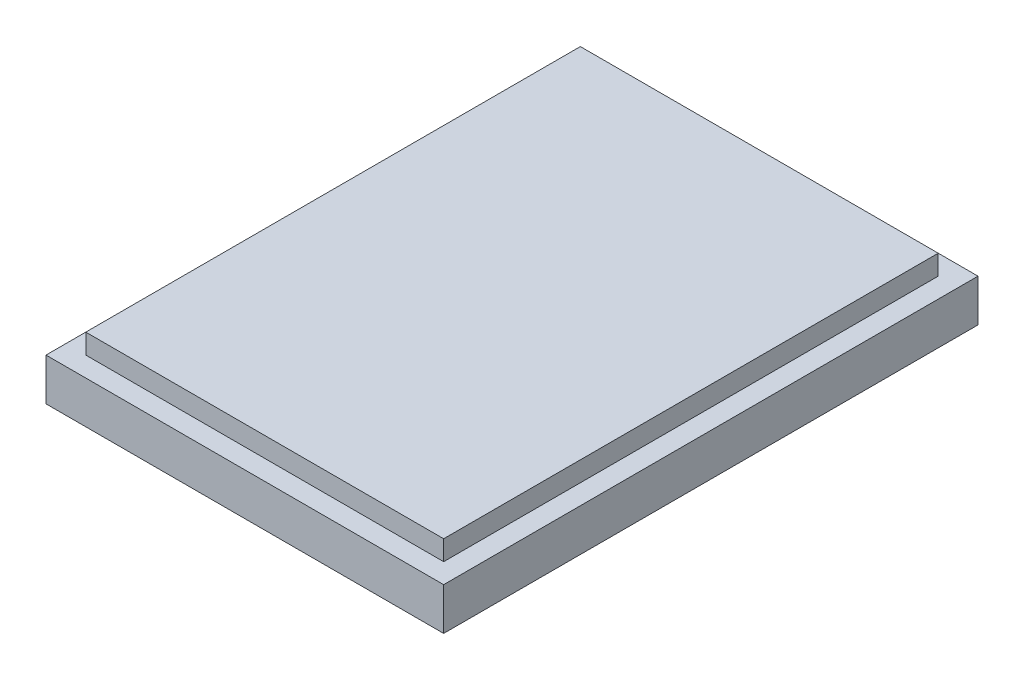
ISO-10303-21;
HEADER;
FILE_DESCRIPTION(('STEP AP214'),'2;1');
FILE_NAME('part.step','',(''),(''),'','','');
FILE_SCHEMA(('AUTOMOTIVE_DESIGN { 1 0 10303 214 1 1 1 1 }'));
ENDSEC;
DATA;
#1=APPLICATION_CONTEXT('core data for automotive mechanical design processes');
#2=APPLICATION_PROTOCOL_DEFINITION('international standard','automotive_design',2000,#1);
#3=PRODUCT_CONTEXT('',#1,'mechanical');
#4=PRODUCT('Part','Part','',(#3));
#5=PRODUCT_RELATED_PRODUCT_CATEGORY('part','',(#4));
#6=PRODUCT_DEFINITION_FORMATION('','',#4);
#7=PRODUCT_DEFINITION_CONTEXT('part definition',#1,'design');
#8=PRODUCT_DEFINITION('design','',#6,#7);
#9=PRODUCT_DEFINITION_SHAPE('','',#8);
#10=(LENGTH_UNIT() NAMED_UNIT(*) SI_UNIT(.MILLI.,.METRE.));
#11=(NAMED_UNIT(*) PLANE_ANGLE_UNIT() SI_UNIT($,.RADIAN.));
#12=(NAMED_UNIT(*) SI_UNIT($,.STERADIAN.) SOLID_ANGLE_UNIT());
#13=UNCERTAINTY_MEASURE_WITH_UNIT(LENGTH_MEASURE(1.E-05),#10,'distance_accuracy_value','');
#14=(GEOMETRIC_REPRESENTATION_CONTEXT(3) GLOBAL_UNCERTAINTY_ASSIGNED_CONTEXT((#13)) GLOBAL_UNIT_ASSIGNED_CONTEXT((#10,
#11,#12)) REPRESENTATION_CONTEXT('',''));
#15=CARTESIAN_POINT('',(0.,0.,0.));
#16=DIRECTION('',(0.,0.,1.));
#17=DIRECTION('',(1.,0.,0.));
#18=AXIS2_PLACEMENT_3D('',#15,#16,#17);
#19=CARTESIAN_POINT('',(0.,7.9375,0.));
#20=DIRECTION('',(1.,0.,0.));
#21=DIRECTION('',(0.,0.,-1.));
#22=AXIS2_PLACEMENT_3D('',#19,#20,#21);
#23=PLANE('',#22);
#24=DIRECTION('',(0.,0.,1.));
#25=VECTOR('',#24,1.);
#26=CARTESIAN_POINT('',(0.,5.3975,-68.2625));
#27=LINE('',#26,#25);
#28=CARTESIAN_POINT('',(0.,5.3975,-68.2625));
#29=VERTEX_POINT('',#28);
#30=CARTESIAN_POINT('',(0.,5.3975,0.));
#31=VERTEX_POINT('',#30);
#32=EDGE_CURVE('E158',#29,#31,#27,.T.);
#33=ORIENTED_EDGE('',*,*,#32,.F.);
#34=DIRECTION('',(0.,-1.,0.));
#35=VECTOR('',#34,1.);
#36=CARTESIAN_POINT('',(0.,7.9375,-68.2625));
#37=LINE('',#36,#35);
#38=CARTESIAN_POINT('',(0.,0.,-68.2625));
#39=VERTEX_POINT('',#38);
#40=EDGE_CURVE('E190',#29,#39,#37,.T.);
#41=ORIENTED_EDGE('',*,*,#40,.T.);
#42=DIRECTION('',(0.,0.,1.));
#43=VECTOR('',#42,1.);
#44=CARTESIAN_POINT('',(0.,0.,0.));
#45=LINE('',#44,#43);
#46=CARTESIAN_POINT('',(0.,0.,0.));
#47=VERTEX_POINT('',#46);
#48=EDGE_CURVE('E174',#39,#47,#45,.T.);
#49=ORIENTED_EDGE('',*,*,#48,.T.);
#50=DIRECTION('',(0.,-1.,0.));
#51=VECTOR('',#50,1.);
#52=CARTESIAN_POINT('',(0.,7.9375,0.));
#53=LINE('',#52,#51);
#54=EDGE_CURVE('E12',#31,#47,#53,.T.);
#55=ORIENTED_EDGE('',*,*,#54,.F.);
#56=EDGE_LOOP('',(#33,#41,#49,#55));
#57=FACE_BOUND('',#56,.T.);
#58=ADVANCED_FACE('F47',(#57),#23,.F.);
#59=CARTESIAN_POINT('',(0.,7.9375,0.));
#60=DIRECTION('',(0.,0.,-1.));
#61=DIRECTION('',(-1.,0.,0.));
#62=AXIS2_PLACEMENT_3D('',#59,#60,#61);
#63=PLANE('',#62);
#64=DIRECTION('',(1.,0.,0.));
#65=VECTOR('',#64,1.);
#66=CARTESIAN_POINT('',(0.,5.3975,0.));
#67=LINE('',#66,#65);
#68=CARTESIAN_POINT('',(50.8,5.3975,0.));
#69=VERTEX_POINT('',#68);
#70=EDGE_CURVE('E166',#31,#69,#67,.T.);
#71=ORIENTED_EDGE('',*,*,#70,.F.);
#72=ORIENTED_EDGE('',*,*,#54,.T.);
#73=DIRECTION('',(1.,0.,0.));
#74=VECTOR('',#73,1.);
#75=CARTESIAN_POINT('',(0.,0.,0.));
#76=LINE('',#75,#74);
#77=CARTESIAN_POINT('',(50.8,0.,0.));
#78=VERTEX_POINT('',#77);
#79=EDGE_CURVE('E178',#47,#78,#76,.T.);
#80=ORIENTED_EDGE('',*,*,#79,.T.);
#81=DIRECTION('',(0.,-1.,0.));
#82=VECTOR('',#81,1.);
#83=CARTESIAN_POINT('',(50.8,7.9375,0.));
#84=LINE('',#83,#82);
#85=EDGE_CURVE('E55',#69,#78,#84,.T.);
#86=ORIENTED_EDGE('',*,*,#85,.F.);
#87=EDGE_LOOP('',(#71,#72,#80,#86));
#88=FACE_BOUND('',#87,.T.);
#89=ADVANCED_FACE('F205',(#88),#63,.F.);
#90=CARTESIAN_POINT('',(50.8,7.9375,0.));
#91=DIRECTION('',(-1.,0.,0.));
#92=DIRECTION('',(0.,0.,1.));
#93=AXIS2_PLACEMENT_3D('',#90,#91,#92);
#94=PLANE('',#93);
#95=DIRECTION('',(0.,0.,-1.));
#96=VECTOR('',#95,1.);
#97=CARTESIAN_POINT('',(50.8,5.3975,0.));
#98=LINE('',#97,#96);
#99=CARTESIAN_POINT('',(50.8,5.3975,-68.2625));
#100=VERTEX_POINT('',#99);
#101=EDGE_CURVE('E62',#69,#100,#98,.T.);
#102=ORIENTED_EDGE('',*,*,#101,.F.);
#103=ORIENTED_EDGE('',*,*,#85,.T.);
#104=DIRECTION('',(0.,0.,-1.));
#105=VECTOR('',#104,1.);
#106=CARTESIAN_POINT('',(50.8,0.,0.));
#107=LINE('',#106,#105);
#108=CARTESIAN_POINT('',(50.8,0.,-68.2625));
#109=VERTEX_POINT('',#108);
#110=EDGE_CURVE('E182',#78,#109,#107,.T.);
#111=ORIENTED_EDGE('',*,*,#110,.T.);
#112=DIRECTION('',(0.,-1.,0.));
#113=VECTOR('',#112,1.);
#114=CARTESIAN_POINT('',(50.8,7.9375,-68.2625));
#115=LINE('',#114,#113);
#116=EDGE_CURVE('E193',#100,#109,#115,.T.);
#117=ORIENTED_EDGE('',*,*,#116,.F.);
#118=EDGE_LOOP('',(#102,#103,#111,#117));
#119=FACE_BOUND('',#118,.T.);
#120=ADVANCED_FACE('F198',(#119),#94,.F.);
#121=CARTESIAN_POINT('',(0.,7.9375,-68.2625));
#122=DIRECTION('',(0.,0.,1.));
#123=DIRECTION('',(1.,0.,0.));
#124=AXIS2_PLACEMENT_3D('',#121,#122,#123);
#125=PLANE('',#124);
#126=DIRECTION('',(-1.,0.,0.));
#127=VECTOR('',#126,1.);
#128=CARTESIAN_POINT('',(50.8,5.3975,-68.2625));
#129=LINE('',#128,#127);
#130=EDGE_CURVE('E171',#100,#29,#129,.T.);
#131=ORIENTED_EDGE('',*,*,#130,.F.);
#132=ORIENTED_EDGE('',*,*,#116,.T.);
#133=DIRECTION('',(-1.,0.,0.));
#134=VECTOR('',#133,1.);
#135=CARTESIAN_POINT('',(0.,0.,-68.2625));
#136=LINE('',#135,#134);
#137=EDGE_CURVE('E186',#109,#39,#136,.T.);
#138=ORIENTED_EDGE('',*,*,#137,.T.);
#139=ORIENTED_EDGE('',*,*,#40,.F.);
#140=EDGE_LOOP('',(#131,#132,#138,#139));
#141=FACE_BOUND('',#140,.T.);
#142=ADVANCED_FACE('F212',(#141),#125,.F.);
#143=CARTESIAN_POINT('',(0.,0.,0.));
#144=DIRECTION('',(0.,-1.,0.));
#145=DIRECTION('',(0.,0.,-1.));
#146=AXIS2_PLACEMENT_3D('',#143,#144,#145);
#147=PLANE('',#146);
#148=ORIENTED_EDGE('',*,*,#48,.F.);
#149=ORIENTED_EDGE('',*,*,#137,.F.);
#150=ORIENTED_EDGE('',*,*,#110,.F.);
#151=ORIENTED_EDGE('',*,*,#79,.F.);
#152=EDGE_LOOP('',(#148,#149,#150,#151));
#153=FACE_BOUND('',#152,.T.);
#154=ADVANCED_FACE('F209',(#153),#147,.T.);
#155=CARTESIAN_POINT('',(0.,5.3975,0.));
#156=DIRECTION('',(0.,1.,0.));
#157=DIRECTION('',(0.,0.,1.));
#158=AXIS2_PLACEMENT_3D('',#155,#156,#157);
#159=PLANE('',#158);
#160=DIRECTION('',(0.,0.,-1.));
#161=VECTOR('',#160,1.);
#162=CARTESIAN_POINT('',(48.26,5.3975,-2.54));
#163=LINE('',#162,#161);
#164=CARTESIAN_POINT('',(48.26,5.3975,-2.54));
#165=VERTEX_POINT('',#164);
#166=CARTESIAN_POINT('',(48.26,5.3975,-65.7225));
#167=VERTEX_POINT('',#166);
#168=EDGE_CURVE('E124',#165,#167,#163,.T.);
#169=ORIENTED_EDGE('',*,*,#168,.F.);
#170=DIRECTION('',(1.,0.,0.));
#171=VECTOR('',#170,1.);
#172=CARTESIAN_POINT('',(2.54,5.3975,-2.54));
#173=LINE('',#172,#171);
#174=CARTESIAN_POINT('',(2.54,5.3975,-2.54));
#175=VERTEX_POINT('',#174);
#176=EDGE_CURVE('E133',#175,#165,#173,.T.);
#177=ORIENTED_EDGE('',*,*,#176,.F.);
#178=DIRECTION('',(0.,0.,1.));
#179=VECTOR('',#178,1.);
#180=CARTESIAN_POINT('',(2.54,5.3975,-65.7225));
#181=LINE('',#180,#179);
#182=CARTESIAN_POINT('',(2.54,5.3975,-65.7225));
#183=VERTEX_POINT('',#182);
#184=EDGE_CURVE('E115',#183,#175,#181,.T.);
#185=ORIENTED_EDGE('',*,*,#184,.F.);
#186=DIRECTION('',(-1.,0.,0.));
#187=VECTOR('',#186,1.);
#188=CARTESIAN_POINT('',(48.26,5.3975,-65.7225));
#189=LINE('',#188,#187);
#190=EDGE_CURVE('E130',#167,#183,#189,.T.);
#191=ORIENTED_EDGE('',*,*,#190,.F.);
#192=EDGE_LOOP('',(#169,#177,#185,#191));
#193=FACE_BOUND('',#192,.T.);
#194=ORIENTED_EDGE('',*,*,#32,.T.);
#195=ORIENTED_EDGE('',*,*,#70,.T.);
#196=ORIENTED_EDGE('',*,*,#101,.T.);
#197=ORIENTED_EDGE('',*,*,#130,.T.);
#198=EDGE_LOOP('',(#194,#195,#196,#197));
#199=FACE_BOUND('',#198,.T.);
#200=ADVANCED_FACE('F129',(#193,#199),#159,.T.);
#201=CARTESIAN_POINT('',(48.26,5.3975,-65.7225));
#202=DIRECTION('',(0.,0.,-1.));
#203=DIRECTION('',(-1.,0.,0.));
#204=AXIS2_PLACEMENT_3D('',#201,#202,#203);
#205=PLANE('',#204);
#206=DIRECTION('',(-1.,0.,0.));
#207=VECTOR('',#206,1.);
#208=CARTESIAN_POINT('',(48.26,7.9375,-65.7225));
#209=LINE('',#208,#207);
#210=CARTESIAN_POINT('',(48.26,7.9375,-65.7225));
#211=VERTEX_POINT('',#210);
#212=CARTESIAN_POINT('',(2.54,7.9375,-65.7225));
#213=VERTEX_POINT('',#212);
#214=EDGE_CURVE('E149',#211,#213,#209,.T.);
#215=ORIENTED_EDGE('',*,*,#214,.F.);
#216=DIRECTION('',(0.,1.,0.));
#217=VECTOR('',#216,1.);
#218=CARTESIAN_POINT('',(48.26,5.3975,-65.7225));
#219=LINE('',#218,#217);
#220=EDGE_CURVE('E137',#167,#211,#219,.T.);
#221=ORIENTED_EDGE('',*,*,#220,.F.);
#222=ORIENTED_EDGE('',*,*,#190,.T.);
#223=DIRECTION('',(0.,1.,0.));
#224=VECTOR('',#223,1.);
#225=CARTESIAN_POINT('',(2.54,5.3975,-65.7225));
#226=LINE('',#225,#224);
#227=EDGE_CURVE('E112',#183,#213,#226,.T.);
#228=ORIENTED_EDGE('',*,*,#227,.T.);
#229=EDGE_LOOP('',(#215,#221,#222,#228));
#230=FACE_BOUND('',#229,.T.);
#231=ADVANCED_FACE('F136',(#230),#205,.T.);
#232=CARTESIAN_POINT('',(48.26,5.3975,-2.54));
#233=DIRECTION('',(1.,0.,0.));
#234=DIRECTION('',(0.,0.,-1.));
#235=AXIS2_PLACEMENT_3D('',#232,#233,#234);
#236=PLANE('',#235);
#237=DIRECTION('',(0.,0.,-1.));
#238=VECTOR('',#237,1.);
#239=CARTESIAN_POINT('',(48.26,7.9375,-2.54));
#240=LINE('',#239,#238);
#241=CARTESIAN_POINT('',(48.26,7.9375,-2.54));
#242=VERTEX_POINT('',#241);
#243=EDGE_CURVE('E139',#242,#211,#240,.T.);
#244=ORIENTED_EDGE('',*,*,#243,.F.);
#245=DIRECTION('',(0.,1.,0.));
#246=VECTOR('',#245,1.);
#247=CARTESIAN_POINT('',(48.26,5.3975,-2.54));
#248=LINE('',#247,#246);
#249=EDGE_CURVE('E159',#165,#242,#248,.T.);
#250=ORIENTED_EDGE('',*,*,#249,.F.);
#251=ORIENTED_EDGE('',*,*,#168,.T.);
#252=ORIENTED_EDGE('',*,*,#220,.T.);
#253=EDGE_LOOP('',(#244,#250,#251,#252));
#254=FACE_BOUND('',#253,.T.);
#255=ADVANCED_FACE('F237',(#254),#236,.T.);
#256=CARTESIAN_POINT('',(2.54,5.3975,-2.54));
#257=DIRECTION('',(0.,0.,1.));
#258=DIRECTION('',(1.,0.,0.));
#259=AXIS2_PLACEMENT_3D('',#256,#257,#258);
#260=PLANE('',#259);
#261=DIRECTION('',(1.,0.,0.));
#262=VECTOR('',#261,1.);
#263=CARTESIAN_POINT('',(2.54,7.9375,-2.54));
#264=LINE('',#263,#262);
#265=CARTESIAN_POINT('',(2.54,7.9375,-2.54));
#266=VERTEX_POINT('',#265);
#267=EDGE_CURVE('E70',#266,#242,#264,.T.);
#268=ORIENTED_EDGE('',*,*,#267,.F.);
#269=DIRECTION('',(0.,1.,0.));
#270=VECTOR('',#269,1.);
#271=CARTESIAN_POINT('',(2.54,5.3975,-2.54));
#272=LINE('',#271,#270);
#273=EDGE_CURVE('E123',#175,#266,#272,.T.);
#274=ORIENTED_EDGE('',*,*,#273,.F.);
#275=ORIENTED_EDGE('',*,*,#176,.T.);
#276=ORIENTED_EDGE('',*,*,#249,.T.);
#277=EDGE_LOOP('',(#268,#274,#275,#276));
#278=FACE_BOUND('',#277,.T.);
#279=ADVANCED_FACE('F240',(#278),#260,.T.);
#280=CARTESIAN_POINT('',(2.54,5.3975,-65.7225));
#281=DIRECTION('',(-1.,0.,0.));
#282=DIRECTION('',(0.,0.,1.));
#283=AXIS2_PLACEMENT_3D('',#280,#281,#282);
#284=PLANE('',#283);
#285=DIRECTION('',(0.,0.,1.));
#286=VECTOR('',#285,1.);
#287=CARTESIAN_POINT('',(2.54,7.9375,-65.7225));
#288=LINE('',#287,#286);
#289=EDGE_CURVE('E117',#213,#266,#288,.T.);
#290=ORIENTED_EDGE('',*,*,#289,.F.);
#291=ORIENTED_EDGE('',*,*,#227,.F.);
#292=ORIENTED_EDGE('',*,*,#184,.T.);
#293=ORIENTED_EDGE('',*,*,#273,.T.);
#294=EDGE_LOOP('',(#290,#291,#292,#293));
#295=FACE_BOUND('',#294,.T.);
#296=ADVANCED_FACE('F114',(#295),#284,.T.);
#297=CARTESIAN_POINT('',(0.,7.9375,0.));
#298=DIRECTION('',(0.,-1.,0.));
#299=DIRECTION('',(0.,0.,-1.));
#300=AXIS2_PLACEMENT_3D('',#297,#298,#299);
#301=PLANE('',#300);
#302=ORIENTED_EDGE('',*,*,#214,.T.);
#303=ORIENTED_EDGE('',*,*,#289,.T.);
#304=ORIENTED_EDGE('',*,*,#267,.T.);
#305=ORIENTED_EDGE('',*,*,#243,.T.);
#306=EDGE_LOOP('',(#302,#303,#304,#305));
#307=FACE_BOUND('',#306,.T.);
#308=ADVANCED_FACE('F229',(#307),#301,.F.);
#309=CLOSED_SHELL('',(#58,#89,#120,#142,#154,#200,#231,#255,#279,#296,#308));
#310=MANIFOLD_SOLID_BREP('B2',#309);
#311=ADVANCED_BREP_SHAPE_REPRESENTATION('',(#18,#310),#14);
#312=SHAPE_DEFINITION_REPRESENTATION(#9,#311);
ENDSEC;
END-ISO-10303-21;
